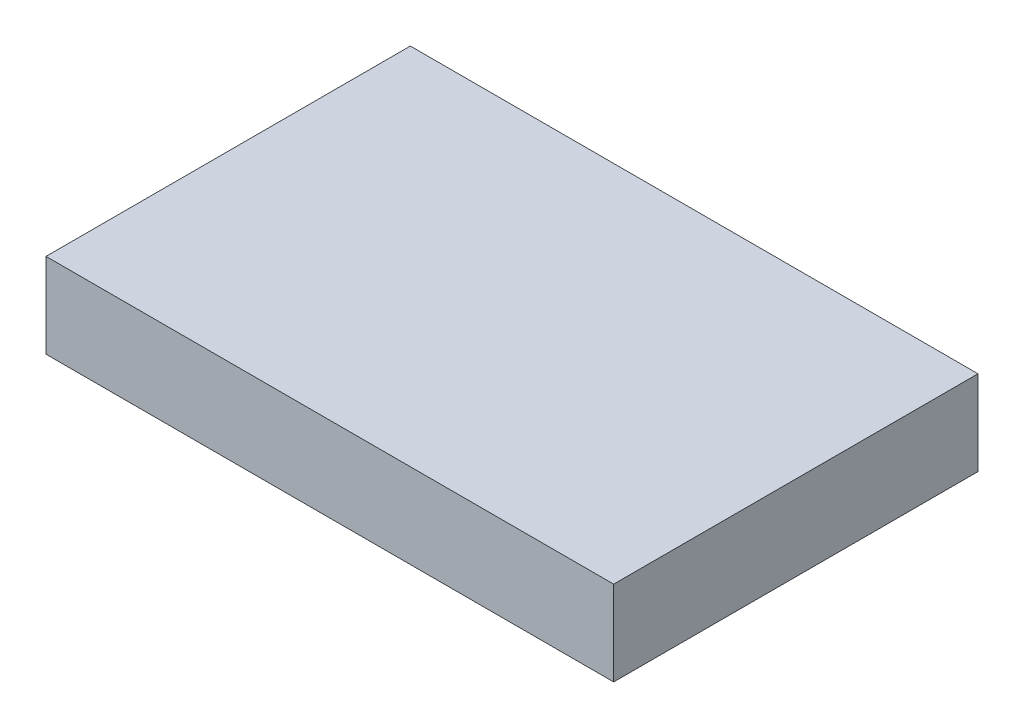
ISO-10303-21;
HEADER;
FILE_DESCRIPTION(('STEP AP214'),'2;1');
FILE_NAME('part.step','',(''),(''),'','','');
FILE_SCHEMA(('AUTOMOTIVE_DESIGN { 1 0 10303 214 1 1 1 1 }'));
ENDSEC;
DATA;
#1=APPLICATION_CONTEXT('core data for automotive mechanical design processes');
#2=APPLICATION_PROTOCOL_DEFINITION('international standard','automotive_design',2000,#1);
#3=PRODUCT_CONTEXT('',#1,'mechanical');
#4=PRODUCT('Part','Part','',(#3));
#5=PRODUCT_RELATED_PRODUCT_CATEGORY('part','',(#4));
#6=PRODUCT_DEFINITION_FORMATION('','',#4);
#7=PRODUCT_DEFINITION_CONTEXT('part definition',#1,'design');
#8=PRODUCT_DEFINITION('design','',#6,#7);
#9=PRODUCT_DEFINITION_SHAPE('','',#8);
#10=(LENGTH_UNIT() NAMED_UNIT(*) SI_UNIT(.MILLI.,.METRE.));
#11=(NAMED_UNIT(*) PLANE_ANGLE_UNIT() SI_UNIT($,.RADIAN.));
#12=(NAMED_UNIT(*) SI_UNIT($,.STERADIAN.) SOLID_ANGLE_UNIT());
#13=UNCERTAINTY_MEASURE_WITH_UNIT(LENGTH_MEASURE(1.E-05),#10,'distance_accuracy_value','');
#14=(GEOMETRIC_REPRESENTATION_CONTEXT(3) GLOBAL_UNCERTAINTY_ASSIGNED_CONTEXT((#13)) GLOBAL_UNIT_ASSIGNED_CONTEXT((#10,
#11,#12)) REPRESENTATION_CONTEXT('',''));
#15=CARTESIAN_POINT('',(0.,0.,0.));
#16=DIRECTION('',(0.,0.,1.));
#17=DIRECTION('',(1.,0.,0.));
#18=AXIS2_PLACEMENT_3D('',#15,#16,#17);
#19=CARTESIAN_POINT('',(0.,2.54,0.));
#20=DIRECTION('',(1.,0.,0.));
#21=DIRECTION('',(0.,0.,-1.));
#22=AXIS2_PLACEMENT_3D('',#19,#20,#21);
#23=PLANE('',#22);
#24=DIRECTION('',(0.,0.,1.));
#25=VECTOR('',#24,1.);
#26=CARTESIAN_POINT('',(0.,0.,0.));
#27=LINE('',#26,#25);
#28=CARTESIAN_POINT('',(0.,0.,-10.922));
#29=VERTEX_POINT('',#28);
#30=CARTESIAN_POINT('',(0.,0.,0.));
#31=VERTEX_POINT('',#30);
#32=EDGE_CURVE('E107',#29,#31,#27,.T.);
#33=ORIENTED_EDGE('',*,*,#32,.T.);
#34=DIRECTION('',(0.,-1.,0.));
#35=VECTOR('',#34,1.);
#36=CARTESIAN_POINT('',(0.,2.54,0.));
#37=LINE('',#36,#35);
#38=CARTESIAN_POINT('',(0.,2.54,0.));
#39=VERTEX_POINT('',#38);
#40=EDGE_CURVE('E11',#39,#31,#37,.T.);
#41=ORIENTED_EDGE('',*,*,#40,.F.);
#42=DIRECTION('',(0.,0.,1.));
#43=VECTOR('',#42,1.);
#44=CARTESIAN_POINT('',(0.,2.54,0.));
#45=LINE('',#44,#43);
#46=CARTESIAN_POINT('',(0.,2.54,-10.922));
#47=VERTEX_POINT('',#46);
#48=EDGE_CURVE('E91',#47,#39,#45,.T.);
#49=ORIENTED_EDGE('',*,*,#48,.F.);
#50=DIRECTION('',(0.,-1.,0.));
#51=VECTOR('',#50,1.);
#52=CARTESIAN_POINT('',(0.,2.54,-10.922));
#53=LINE('',#52,#51);
#54=EDGE_CURVE('E103',#47,#29,#53,.T.);
#55=ORIENTED_EDGE('',*,*,#54,.T.);
#56=EDGE_LOOP('',(#33,#41,#49,#55));
#57=FACE_BOUND('',#56,.T.);
#58=ADVANCED_FACE('F39',(#57),#23,.F.);
#59=CARTESIAN_POINT('',(0.,2.54,0.));
#60=DIRECTION('',(0.,0.,-1.));
#61=DIRECTION('',(-1.,0.,0.));
#62=AXIS2_PLACEMENT_3D('',#59,#60,#61);
#63=PLANE('',#62);
#64=DIRECTION('',(1.,0.,0.));
#65=VECTOR('',#64,1.);
#66=CARTESIAN_POINT('',(0.,0.,0.));
#67=LINE('',#66,#65);
#68=CARTESIAN_POINT('',(17.018,0.,0.));
#69=VERTEX_POINT('',#68);
#70=EDGE_CURVE('E96',#31,#69,#67,.T.);
#71=ORIENTED_EDGE('',*,*,#70,.T.);
#72=DIRECTION('',(0.,-1.,0.));
#73=VECTOR('',#72,1.);
#74=CARTESIAN_POINT('',(17.018,2.54,0.));
#75=LINE('',#74,#73);
#76=CARTESIAN_POINT('',(17.018,2.54,0.));
#77=VERTEX_POINT('',#76);
#78=EDGE_CURVE('E48',#77,#69,#75,.T.);
#79=ORIENTED_EDGE('',*,*,#78,.F.);
#80=DIRECTION('',(1.,0.,0.));
#81=VECTOR('',#80,1.);
#82=CARTESIAN_POINT('',(0.,2.54,0.));
#83=LINE('',#82,#81);
#84=EDGE_CURVE('E86',#39,#77,#83,.T.);
#85=ORIENTED_EDGE('',*,*,#84,.F.);
#86=ORIENTED_EDGE('',*,*,#40,.T.);
#87=EDGE_LOOP('',(#71,#79,#85,#86));
#88=FACE_BOUND('',#87,.T.);
#89=ADVANCED_FACE('F95',(#88),#63,.F.);
#90=CARTESIAN_POINT('',(17.018,2.54,0.));
#91=DIRECTION('',(-1.,0.,0.));
#92=DIRECTION('',(0.,0.,1.));
#93=AXIS2_PLACEMENT_3D('',#90,#91,#92);
#94=PLANE('',#93);
#95=DIRECTION('',(0.,0.,-1.));
#96=VECTOR('',#95,1.);
#97=CARTESIAN_POINT('',(17.018,0.,0.));
#98=LINE('',#97,#96);
#99=CARTESIAN_POINT('',(17.018,0.,-10.922));
#100=VERTEX_POINT('',#99);
#101=EDGE_CURVE('E73',#69,#100,#98,.T.);
#102=ORIENTED_EDGE('',*,*,#101,.T.);
#103=DIRECTION('',(0.,-1.,0.));
#104=VECTOR('',#103,1.);
#105=CARTESIAN_POINT('',(17.018,2.54,-10.922));
#106=LINE('',#105,#104);
#107=CARTESIAN_POINT('',(17.018,2.54,-10.922));
#108=VERTEX_POINT('',#107);
#109=EDGE_CURVE('E98',#108,#100,#106,.T.);
#110=ORIENTED_EDGE('',*,*,#109,.F.);
#111=DIRECTION('',(0.,0.,-1.));
#112=VECTOR('',#111,1.);
#113=CARTESIAN_POINT('',(17.018,2.54,0.));
#114=LINE('',#113,#112);
#115=EDGE_CURVE('E89',#77,#108,#114,.T.);
#116=ORIENTED_EDGE('',*,*,#115,.F.);
#117=ORIENTED_EDGE('',*,*,#78,.T.);
#118=EDGE_LOOP('',(#102,#110,#116,#117));
#119=FACE_BOUND('',#118,.T.);
#120=ADVANCED_FACE('F99',(#119),#94,.F.);
#121=CARTESIAN_POINT('',(0.,2.54,-10.922));
#122=DIRECTION('',(0.,0.,1.));
#123=DIRECTION('',(1.,0.,0.));
#124=AXIS2_PLACEMENT_3D('',#121,#122,#123);
#125=PLANE('',#124);
#126=DIRECTION('',(-1.,0.,0.));
#127=VECTOR('',#126,1.);
#128=CARTESIAN_POINT('',(0.,0.,-10.922));
#129=LINE('',#128,#127);
#130=EDGE_CURVE('E79',#100,#29,#129,.T.);
#131=ORIENTED_EDGE('',*,*,#130,.T.);
#132=ORIENTED_EDGE('',*,*,#54,.F.);
#133=DIRECTION('',(-1.,0.,0.));
#134=VECTOR('',#133,1.);
#135=CARTESIAN_POINT('',(0.,2.54,-10.922));
#136=LINE('',#135,#134);
#137=EDGE_CURVE('E56',#108,#47,#136,.T.);
#138=ORIENTED_EDGE('',*,*,#137,.F.);
#139=ORIENTED_EDGE('',*,*,#109,.T.);
#140=EDGE_LOOP('',(#131,#132,#138,#139));
#141=FACE_BOUND('',#140,.T.);
#142=ADVANCED_FACE('F120',(#141),#125,.F.);
#143=CARTESIAN_POINT('',(0.,2.54,0.));
#144=DIRECTION('',(0.,-1.,0.));
#145=DIRECTION('',(0.,0.,-1.));
#146=AXIS2_PLACEMENT_3D('',#143,#144,#145);
#147=PLANE('',#146);
#148=ORIENTED_EDGE('',*,*,#48,.T.);
#149=ORIENTED_EDGE('',*,*,#84,.T.);
#150=ORIENTED_EDGE('',*,*,#115,.T.);
#151=ORIENTED_EDGE('',*,*,#137,.T.);
#152=EDGE_LOOP('',(#148,#149,#150,#151));
#153=FACE_BOUND('',#152,.T.);
#154=ADVANCED_FACE('F87',(#153),#147,.F.);
#155=CARTESIAN_POINT('',(0.,0.,0.));
#156=DIRECTION('',(0.,-1.,0.));
#157=DIRECTION('',(0.,0.,-1.));
#158=AXIS2_PLACEMENT_3D('',#155,#156,#157);
#159=PLANE('',#158);
#160=ORIENTED_EDGE('',*,*,#32,.F.);
#161=ORIENTED_EDGE('',*,*,#130,.F.);
#162=ORIENTED_EDGE('',*,*,#101,.F.);
#163=ORIENTED_EDGE('',*,*,#70,.F.);
#164=EDGE_LOOP('',(#160,#161,#162,#163));
#165=FACE_BOUND('',#164,.T.);
#166=ADVANCED_FACE('F123',(#165),#159,.T.);
#167=CLOSED_SHELL('',(#58,#89,#120,#142,#154,#166));
#168=MANIFOLD_SOLID_BREP('B2',#167);
#169=ADVANCED_BREP_SHAPE_REPRESENTATION('',(#18,#168),#14);
#170=SHAPE_DEFINITION_REPRESENTATION(#9,#169);
ENDSEC;
END-ISO-10303-21;
